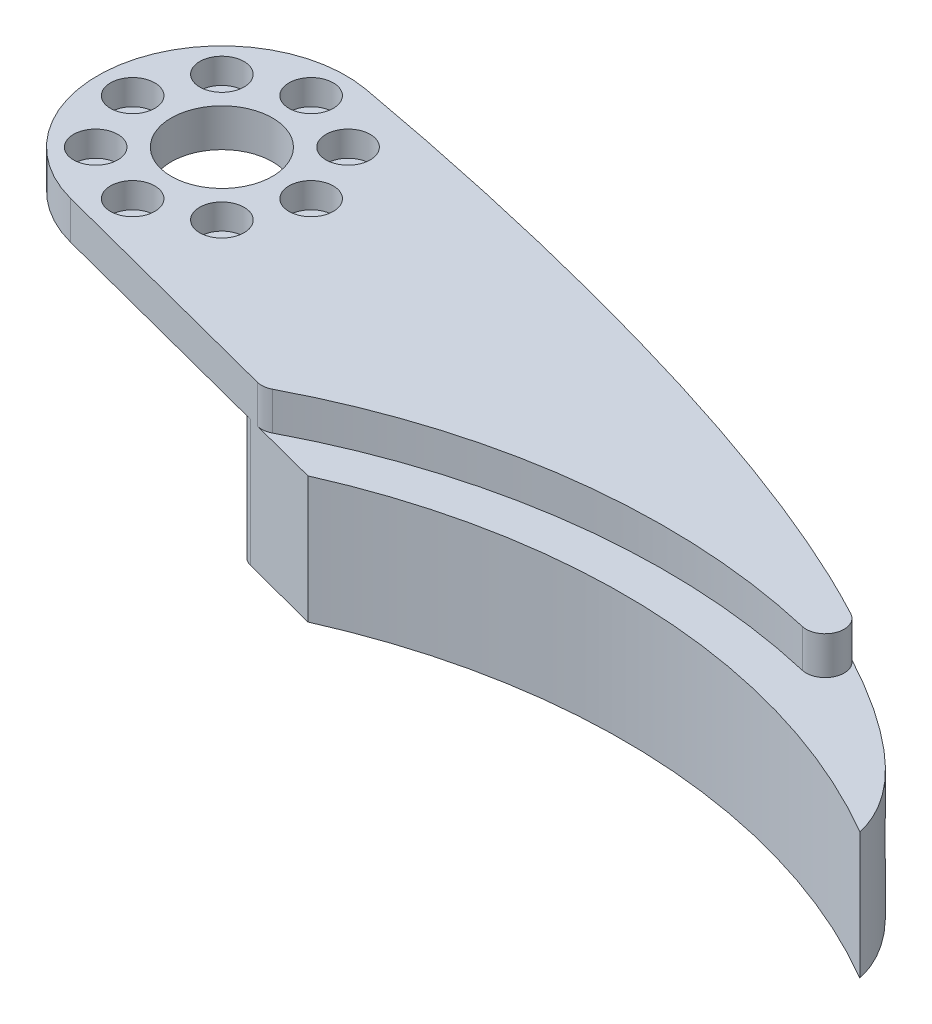
ISO-10303-21;
HEADER;
FILE_DESCRIPTION(('STEP AP214'),'2;1');
FILE_NAME('part.step','',(''),(''),'','','');
FILE_SCHEMA(('AUTOMOTIVE_DESIGN { 1 0 10303 214 1 1 1 1 }'));
ENDSEC;
DATA;
#1=APPLICATION_CONTEXT('core data for automotive mechanical design processes');
#2=APPLICATION_PROTOCOL_DEFINITION('international standard','automotive_design',2000,#1);
#3=PRODUCT_CONTEXT('',#1,'mechanical');
#4=PRODUCT('Part','Part','',(#3));
#5=PRODUCT_RELATED_PRODUCT_CATEGORY('part','',(#4));
#6=PRODUCT_DEFINITION_FORMATION('','',#4);
#7=PRODUCT_DEFINITION_CONTEXT('part definition',#1,'design');
#8=PRODUCT_DEFINITION('design','',#6,#7);
#9=PRODUCT_DEFINITION_SHAPE('','',#8);
#10=(LENGTH_UNIT() NAMED_UNIT(*) SI_UNIT(.MILLI.,.METRE.));
#11=(NAMED_UNIT(*) PLANE_ANGLE_UNIT() SI_UNIT($,.RADIAN.));
#12=(NAMED_UNIT(*) SI_UNIT($,.STERADIAN.) SOLID_ANGLE_UNIT());
#13=UNCERTAINTY_MEASURE_WITH_UNIT(LENGTH_MEASURE(1.E-05),#10,'distance_accuracy_value','');
#14=(GEOMETRIC_REPRESENTATION_CONTEXT(3) GLOBAL_UNCERTAINTY_ASSIGNED_CONTEXT((#13)) GLOBAL_UNIT_ASSIGNED_CONTEXT((#10,
#11,#12)) REPRESENTATION_CONTEXT('',''));
#15=CARTESIAN_POINT('',(0.,0.,0.));
#16=DIRECTION('',(0.,0.,1.));
#17=DIRECTION('',(1.,0.,0.));
#18=AXIS2_PLACEMENT_3D('',#15,#16,#17);
#19=CARTESIAN_POINT('',(4.98510280736516,3.,-4.98510280736516));
#20=DIRECTION('',(0.,-1.,0.));
#21=DIRECTION('',(0.,0.,-1.));
#22=AXIS2_PLACEMENT_3D('',#19,#20,#21);
#23=CYLINDRICAL_SURFACE('',#22,1.);
#24=CARTESIAN_POINT('',(4.98510280736516,0.,-4.98510280736516));
#25=DIRECTION('',(0.,1.,0.));
#26=DIRECTION('',(0.,0.,1.));
#27=AXIS2_PLACEMENT_3D('',#24,#25,#26);
#28=CIRCLE('',#27,1.);
#29=CARTESIAN_POINT('',(4.98510280736516,0.,-3.98510280736516));
#30=VERTEX_POINT('',#29);
#31=EDGE_CURVE('E306',#30,#30,#28,.T.);
#32=ORIENTED_EDGE('',*,*,#31,.F.);
#33=EDGE_LOOP('',(#32));
#34=FACE_BOUND('',#33,.T.);
#35=CARTESIAN_POINT('',(4.98510280736516,1.,-4.98510280736516));
#36=DIRECTION('',(0.,1.,0.));
#37=DIRECTION('',(0.,0.,1.));
#38=AXIS2_PLACEMENT_3D('',#35,#36,#37);
#39=CIRCLE('',#38,1.);
#40=CARTESIAN_POINT('',(4.98510280736516,1.,-3.98510280736516));
#41=VERTEX_POINT('',#40);
#42=EDGE_CURVE('E169',#41,#41,#39,.T.);
#43=ORIENTED_EDGE('',*,*,#42,.T.);
#44=EDGE_LOOP('',(#43));
#45=FACE_BOUND('',#44,.T.);
#46=ADVANCED_FACE('F45',(#34,#45),#23,.F.);
#47=CARTESIAN_POINT('',(7.05,3.,0.));
#48=DIRECTION('',(0.,-1.,0.));
#49=DIRECTION('',(0.,0.,-1.));
#50=AXIS2_PLACEMENT_3D('',#47,#48,#49);
#51=CYLINDRICAL_SURFACE('',#50,1.);
#52=CARTESIAN_POINT('',(7.05,0.,0.));
#53=DIRECTION('',(0.,1.,0.));
#54=DIRECTION('',(0.,0.,1.));
#55=AXIS2_PLACEMENT_3D('',#52,#53,#54);
#56=CIRCLE('',#55,1.);
#57=CARTESIAN_POINT('',(7.05,0.,1.));
#58=VERTEX_POINT('',#57);
#59=EDGE_CURVE('E303',#58,#58,#56,.T.);
#60=ORIENTED_EDGE('',*,*,#59,.F.);
#61=EDGE_LOOP('',(#60));
#62=FACE_BOUND('',#61,.T.);
#63=CARTESIAN_POINT('',(7.05,1.,0.));
#64=DIRECTION('',(0.,1.,0.));
#65=DIRECTION('',(0.,0.,1.));
#66=AXIS2_PLACEMENT_3D('',#63,#64,#65);
#67=CIRCLE('',#66,1.);
#68=CARTESIAN_POINT('',(7.05,1.,1.));
#69=VERTEX_POINT('',#68);
#70=EDGE_CURVE('E334',#69,#69,#67,.T.);
#71=ORIENTED_EDGE('',*,*,#70,.T.);
#72=EDGE_LOOP('',(#71));
#73=FACE_BOUND('',#72,.T.);
#74=ADVANCED_FACE('F217',(#62,#73),#51,.F.);
#75=CARTESIAN_POINT('',(4.98510280736516,3.,4.98510280736516));
#76=DIRECTION('',(0.,-1.,0.));
#77=DIRECTION('',(0.,0.,-1.));
#78=AXIS2_PLACEMENT_3D('',#75,#76,#77);
#79=CYLINDRICAL_SURFACE('',#78,1.);
#80=CARTESIAN_POINT('',(4.98510280736516,0.,4.98510280736516));
#81=DIRECTION('',(0.,1.,0.));
#82=DIRECTION('',(0.,0.,1.));
#83=AXIS2_PLACEMENT_3D('',#80,#81,#82);
#84=CIRCLE('',#83,1.);
#85=CARTESIAN_POINT('',(4.98510280736516,0.,5.98510280736516));
#86=VERTEX_POINT('',#85);
#87=EDGE_CURVE('E300',#86,#86,#84,.T.);
#88=ORIENTED_EDGE('',*,*,#87,.F.);
#89=EDGE_LOOP('',(#88));
#90=FACE_BOUND('',#89,.T.);
#91=CARTESIAN_POINT('',(4.98510280736516,1.,4.98510280736516));
#92=DIRECTION('',(0.,1.,0.));
#93=DIRECTION('',(0.,0.,1.));
#94=AXIS2_PLACEMENT_3D('',#91,#92,#93);
#95=CIRCLE('',#94,1.);
#96=CARTESIAN_POINT('',(4.98510280736516,1.,5.98510280736516));
#97=VERTEX_POINT('',#96);
#98=EDGE_CURVE('E331',#97,#97,#95,.T.);
#99=ORIENTED_EDGE('',*,*,#98,.T.);
#100=EDGE_LOOP('',(#99));
#101=FACE_BOUND('',#100,.T.);
#102=ADVANCED_FACE('F224',(#90,#101),#79,.F.);
#103=CARTESIAN_POINT('',(0.,3.,7.05));
#104=DIRECTION('',(0.,-1.,0.));
#105=DIRECTION('',(0.,0.,-1.));
#106=AXIS2_PLACEMENT_3D('',#103,#104,#105);
#107=CYLINDRICAL_SURFACE('',#106,1.);
#108=CARTESIAN_POINT('',(0.,0.,7.05));
#109=DIRECTION('',(0.,1.,0.));
#110=DIRECTION('',(0.,0.,1.));
#111=AXIS2_PLACEMENT_3D('',#108,#109,#110);
#112=CIRCLE('',#111,1.);
#113=CARTESIAN_POINT('',(0.,0.,8.05));
#114=VERTEX_POINT('',#113);
#115=EDGE_CURVE('E297',#114,#114,#112,.T.);
#116=ORIENTED_EDGE('',*,*,#115,.F.);
#117=EDGE_LOOP('',(#116));
#118=FACE_BOUND('',#117,.T.);
#119=CARTESIAN_POINT('',(0.,1.,7.05));
#120=DIRECTION('',(0.,1.,0.));
#121=DIRECTION('',(0.,0.,1.));
#122=AXIS2_PLACEMENT_3D('',#119,#120,#121);
#123=CIRCLE('',#122,1.);
#124=CARTESIAN_POINT('',(0.,1.,8.05));
#125=VERTEX_POINT('',#124);
#126=EDGE_CURVE('E328',#125,#125,#123,.T.);
#127=ORIENTED_EDGE('',*,*,#126,.T.);
#128=EDGE_LOOP('',(#127));
#129=FACE_BOUND('',#128,.T.);
#130=ADVANCED_FACE('F234',(#118,#129),#107,.F.);
#131=CARTESIAN_POINT('',(-4.98510280736516,3.,4.98510280736516));
#132=DIRECTION('',(0.,-1.,0.));
#133=DIRECTION('',(0.,0.,-1.));
#134=AXIS2_PLACEMENT_3D('',#131,#132,#133);
#135=CYLINDRICAL_SURFACE('',#134,1.);
#136=CARTESIAN_POINT('',(-4.98510280736516,0.,4.98510280736516));
#137=DIRECTION('',(0.,1.,0.));
#138=DIRECTION('',(0.,0.,1.));
#139=AXIS2_PLACEMENT_3D('',#136,#137,#138);
#140=CIRCLE('',#139,1.);
#141=CARTESIAN_POINT('',(-4.98510280736516,0.,5.98510280736516));
#142=VERTEX_POINT('',#141);
#143=EDGE_CURVE('E294',#142,#142,#140,.T.);
#144=ORIENTED_EDGE('',*,*,#143,.F.);
#145=EDGE_LOOP('',(#144));
#146=FACE_BOUND('',#145,.T.);
#147=CARTESIAN_POINT('',(-4.98510280736516,1.,4.98510280736516));
#148=DIRECTION('',(0.,1.,0.));
#149=DIRECTION('',(0.,0.,1.));
#150=AXIS2_PLACEMENT_3D('',#147,#148,#149);
#151=CIRCLE('',#150,1.);
#152=CARTESIAN_POINT('',(-4.98510280736516,1.,5.98510280736516));
#153=VERTEX_POINT('',#152);
#154=EDGE_CURVE('E325',#153,#153,#151,.T.);
#155=ORIENTED_EDGE('',*,*,#154,.T.);
#156=EDGE_LOOP('',(#155));
#157=FACE_BOUND('',#156,.T.);
#158=ADVANCED_FACE('F238',(#146,#157),#135,.F.);
#159=CARTESIAN_POINT('',(-7.05,3.,0.));
#160=DIRECTION('',(0.,-1.,0.));
#161=DIRECTION('',(0.,0.,-1.));
#162=AXIS2_PLACEMENT_3D('',#159,#160,#161);
#163=CYLINDRICAL_SURFACE('',#162,1.);
#164=CARTESIAN_POINT('',(-7.05,0.,0.));
#165=DIRECTION('',(0.,1.,0.));
#166=DIRECTION('',(0.,0.,1.));
#167=AXIS2_PLACEMENT_3D('',#164,#165,#166);
#168=CIRCLE('',#167,1.);
#169=CARTESIAN_POINT('',(-7.05,0.,1.));
#170=VERTEX_POINT('',#169);
#171=EDGE_CURVE('E291',#170,#170,#168,.T.);
#172=ORIENTED_EDGE('',*,*,#171,.F.);
#173=EDGE_LOOP('',(#172));
#174=FACE_BOUND('',#173,.T.);
#175=CARTESIAN_POINT('',(-7.05,1.,0.));
#176=DIRECTION('',(0.,1.,0.));
#177=DIRECTION('',(0.,0.,1.));
#178=AXIS2_PLACEMENT_3D('',#175,#176,#177);
#179=CIRCLE('',#178,1.);
#180=CARTESIAN_POINT('',(-7.05,1.,1.));
#181=VERTEX_POINT('',#180);
#182=EDGE_CURVE('E322',#181,#181,#179,.T.);
#183=ORIENTED_EDGE('',*,*,#182,.T.);
#184=EDGE_LOOP('',(#183));
#185=FACE_BOUND('',#184,.T.);
#186=ADVANCED_FACE('F242',(#174,#185),#163,.F.);
#187=CARTESIAN_POINT('',(-4.98510280736516,3.,-4.98510280736516));
#188=DIRECTION('',(0.,-1.,0.));
#189=DIRECTION('',(0.,0.,-1.));
#190=AXIS2_PLACEMENT_3D('',#187,#188,#189);
#191=CYLINDRICAL_SURFACE('',#190,1.);
#192=CARTESIAN_POINT('',(-4.98510280736516,0.,-4.98510280736516));
#193=DIRECTION('',(0.,1.,0.));
#194=DIRECTION('',(0.,0.,1.));
#195=AXIS2_PLACEMENT_3D('',#192,#193,#194);
#196=CIRCLE('',#195,1.);
#197=CARTESIAN_POINT('',(-4.98510280736516,0.,-3.98510280736516));
#198=VERTEX_POINT('',#197);
#199=EDGE_CURVE('E288',#198,#198,#196,.T.);
#200=ORIENTED_EDGE('',*,*,#199,.F.);
#201=EDGE_LOOP('',(#200));
#202=FACE_BOUND('',#201,.T.);
#203=CARTESIAN_POINT('',(-4.98510280736516,1.,-4.98510280736516));
#204=DIRECTION('',(0.,1.,0.));
#205=DIRECTION('',(0.,0.,1.));
#206=AXIS2_PLACEMENT_3D('',#203,#204,#205);
#207=CIRCLE('',#206,1.);
#208=CARTESIAN_POINT('',(-4.98510280736516,1.,-3.98510280736516));
#209=VERTEX_POINT('',#208);
#210=EDGE_CURVE('E318',#209,#209,#207,.T.);
#211=ORIENTED_EDGE('',*,*,#210,.T.);
#212=EDGE_LOOP('',(#211));
#213=FACE_BOUND('',#212,.T.);
#214=ADVANCED_FACE('F246',(#202,#213),#191,.F.);
#215=CARTESIAN_POINT('',(0.,3.,-7.05));
#216=DIRECTION('',(0.,-1.,0.));
#217=DIRECTION('',(0.,0.,-1.));
#218=AXIS2_PLACEMENT_3D('',#215,#216,#217);
#219=CYLINDRICAL_SURFACE('',#218,1.);
#220=CARTESIAN_POINT('',(0.,0.,-7.05));
#221=DIRECTION('',(0.,1.,0.));
#222=DIRECTION('',(0.,0.,1.));
#223=AXIS2_PLACEMENT_3D('',#220,#221,#222);
#224=CIRCLE('',#223,1.);
#225=CARTESIAN_POINT('',(0.,0.,-6.05));
#226=VERTEX_POINT('',#225);
#227=EDGE_CURVE('E187',#226,#226,#224,.T.);
#228=ORIENTED_EDGE('',*,*,#227,.F.);
#229=EDGE_LOOP('',(#228));
#230=FACE_BOUND('',#229,.T.);
#231=CARTESIAN_POINT('',(0.,1.,-7.05));
#232=DIRECTION('',(0.,1.,0.));
#233=DIRECTION('',(0.,0.,1.));
#234=AXIS2_PLACEMENT_3D('',#231,#232,#233);
#235=CIRCLE('',#234,1.);
#236=CARTESIAN_POINT('',(0.,1.,-6.05));
#237=VERTEX_POINT('',#236);
#238=EDGE_CURVE('E315',#237,#237,#235,.T.);
#239=ORIENTED_EDGE('',*,*,#238,.T.);
#240=EDGE_LOOP('',(#239));
#241=FACE_BOUND('',#240,.T.);
#242=ADVANCED_FACE('F198',(#230,#241),#219,.F.);
#243=CARTESIAN_POINT('',(1.75302173497441,3.,-9.64193522052017));
#244=CARTESIAN_POINT('',(36.7830483573597,3.,-3.27304799598428));
#245=CARTESIAN_POINT('',(66.7324408129762,3.,7.92121814505391));
#246=CARTESIAN_POINT('',(69.0419589287704,3.,18.6455545202918));
#247=B_SPLINE_CURVE_WITH_KNOTS('',3,(#243,#244,#245,#246),.UNSPECIFIED.,.F.,.F.,(4,4),(0.,1.),.UNSPECIFIED.);
#248=DIRECTION('',(0.,-1.,0.));
#249=VECTOR('',#248,1.);
#250=SURFACE_OF_LINEAR_EXTRUSION('',#247,#249);
#251=CARTESIAN_POINT('',(1.75302173497441,-10.,-9.64193522052017));
#252=CARTESIAN_POINT('',(36.7830483573597,-10.,-3.27304799598428));
#253=CARTESIAN_POINT('',(66.7324408129762,-10.,7.92121814505391));
#254=CARTESIAN_POINT('',(69.0419589287704,-10.,18.6455545202918));
#255=B_SPLINE_CURVE_WITH_KNOTS('',3,(#251,#252,#253,#254),.UNSPECIFIED.,.F.,.F.,(4,4),(0.,1.),.UNSPECIFIED.);
#256=CARTESIAN_POINT('',(55.0089054922224,-10.,6.16908967782891));
#257=VERTEX_POINT('',#256);
#258=CARTESIAN_POINT('',(69.0419589287705,-10.,18.6455545202918));
#259=VERTEX_POINT('',#258);
#260=EDGE_CURVE('E159',#257,#259,#255,.T.);
#261=ORIENTED_EDGE('',*,*,#260,.F.);
#262=DIRECTION('',(0.,-1.,0.));
#263=VECTOR('',#262,1.);
#264=CARTESIAN_POINT('',(55.0089054922224,-10.,6.16908967782892));
#265=LINE('',#264,#263);
#266=CARTESIAN_POINT('',(55.0089054922136,0.,6.1690896778245));
#267=VERTEX_POINT('',#266);
#268=EDGE_CURVE('E341',#257,#267,#265,.F.);
#269=ORIENTED_EDGE('',*,*,#268,.T.);
#270=CARTESIAN_POINT('',(1.75302173497441,0.,-9.64193522052017));
#271=CARTESIAN_POINT('',(36.7830483573597,0.,-3.27304799598428));
#272=CARTESIAN_POINT('',(66.7324408129762,0.,7.92121814505391));
#273=CARTESIAN_POINT('',(69.0419589287704,0.,18.6455545202918));
#274=B_SPLINE_CURVE_WITH_KNOTS('',3,(#270,#271,#272,#273),.UNSPECIFIED.,.F.,.F.,(4,4),(0.,1.),.UNSPECIFIED.);
#275=CARTESIAN_POINT('',(1.75302173497441,0.,-9.64193522052017));
#276=VERTEX_POINT('',#275);
#277=EDGE_CURVE('E178',#276,#267,#274,.T.);
#278=ORIENTED_EDGE('',*,*,#277,.F.);
#279=DIRECTION('',(0.,-1.,0.));
#280=VECTOR('',#279,1.);
#281=CARTESIAN_POINT('',(1.75302173497441,3.,-9.64193522052017));
#282=LINE('',#281,#280);
#283=CARTESIAN_POINT('',(1.75302173497441,3.,-9.64193522052017));
#284=VERTEX_POINT('',#283);
#285=EDGE_CURVE('E272',#284,#276,#282,.T.);
#286=ORIENTED_EDGE('',*,*,#285,.F.);
#287=CARTESIAN_POINT('',(56.770531976888,3.,7.08288433158837));
#288=VERTEX_POINT('',#287);
#289=EDGE_CURVE('E180',#284,#288,#247,.T.);
#290=ORIENTED_EDGE('',*,*,#289,.T.);
#291=DIRECTION('',(0.,-1.,0.));
#292=VECTOR('',#291,1.);
#293=CARTESIAN_POINT('',(56.770531976888,3.,7.0828843315884));
#294=LINE('',#293,#292);
#295=CARTESIAN_POINT('',(56.770531976888,0.,7.08288433158839));
#296=VERTEX_POINT('',#295);
#297=EDGE_CURVE('E314',#288,#296,#294,.T.);
#298=ORIENTED_EDGE('',*,*,#297,.T.);
#299=CARTESIAN_POINT('',(1.75302173497441,0.,-9.64193522052017));
#300=CARTESIAN_POINT('',(36.7830483573597,0.,-3.27304799598428));
#301=CARTESIAN_POINT('',(66.7324408129762,0.,7.92121814505391));
#302=CARTESIAN_POINT('',(69.0419589287704,0.,18.6455545202918));
#303=B_SPLINE_CURVE_WITH_KNOTS('',3,(#299,#300,#301,#302),.UNSPECIFIED.,.F.,.F.,(4,4),(0.,1.),.UNSPECIFIED.);
#304=CARTESIAN_POINT('',(69.0419589287705,0.,18.6455545202918));
#305=VERTEX_POINT('',#304);
#306=EDGE_CURVE('E164',#296,#305,#303,.T.);
#307=ORIENTED_EDGE('',*,*,#306,.T.);
#308=DIRECTION('',(0.,1.,0.));
#309=VECTOR('',#308,1.);
#310=CARTESIAN_POINT('',(69.0419589287705,-10.,18.6455545202918));
#311=LINE('',#310,#309);
#312=EDGE_CURVE('E145',#259,#305,#311,.T.);
#313=ORIENTED_EDGE('',*,*,#312,.F.);
#314=EDGE_LOOP('',(#261,#269,#278,#286,#290,#298,#307,#313));
#315=FACE_BOUND('',#314,.T.);
#316=ADVANCED_FACE('F193',(#315),#250,.T.);
#317=CARTESIAN_POINT('',(0.,3.,0.));
#318=DIRECTION('',(0.,-1.,0.));
#319=DIRECTION('',(0.,0.,-1.));
#320=AXIS2_PLACEMENT_3D('',#317,#318,#319);
#321=CYLINDRICAL_SURFACE('',#320,9.8);
#322=CARTESIAN_POINT('',(0.,0.,0.));
#323=DIRECTION('',(0.,1.,0.));
#324=DIRECTION('',(0.,0.,1.));
#325=AXIS2_PLACEMENT_3D('',#322,#323,#324);
#326=CIRCLE('',#325,9.8);
#327=CARTESIAN_POINT('',(-2.47048704337769,0.,9.4834958622073));
#328=VERTEX_POINT('',#327);
#329=EDGE_CURVE('E268',#276,#328,#326,.T.);
#330=ORIENTED_EDGE('',*,*,#329,.T.);
#331=DIRECTION('',(0.,-1.,0.));
#332=VECTOR('',#331,1.);
#333=CARTESIAN_POINT('',(-2.47048704337769,3.,9.4834958622073));
#334=LINE('',#333,#332);
#335=CARTESIAN_POINT('',(-2.47048704337769,3.,9.4834958622073));
#336=VERTEX_POINT('',#335);
#337=EDGE_CURVE('E271',#336,#328,#334,.T.);
#338=ORIENTED_EDGE('',*,*,#337,.F.);
#339=CARTESIAN_POINT('',(0.,3.,0.));
#340=DIRECTION('',(0.,1.,0.));
#341=DIRECTION('',(0.,0.,1.));
#342=AXIS2_PLACEMENT_3D('',#339,#340,#341);
#343=CIRCLE('',#342,9.8);
#344=EDGE_CURVE('E186',#284,#336,#343,.T.);
#345=ORIENTED_EDGE('',*,*,#344,.F.);
#346=ORIENTED_EDGE('',*,*,#285,.T.);
#347=EDGE_LOOP('',(#330,#338,#345,#346));
#348=FACE_BOUND('',#347,.T.);
#349=ADVANCED_FACE('F197',(#348),#321,.T.);
#350=CARTESIAN_POINT('',(-2.47048704337769,3.,9.4834958622073));
#351=DIRECTION('',(-0.252090514630377,0.,0.967703659408908));
#352=DIRECTION('',(0.967703659408908,0.,0.252090514630377));
#353=AXIS2_PLACEMENT_3D('',#350,#351,#352);
#354=PLANE('',#353);
#355=DIRECTION('',(-0.967703659408908,0.,-0.252090514630377));
#356=VECTOR('',#355,1.);
#357=CARTESIAN_POINT('',(-2.47048704337769,0.,9.4834958622073));
#358=LINE('',#357,#356);
#359=CARTESIAN_POINT('',(16.7542198939808,0.,14.4916057503286));
#360=VERTEX_POINT('',#359);
#361=EDGE_CURVE('E275',#360,#328,#358,.T.);
#362=ORIENTED_EDGE('',*,*,#361,.F.);
#363=DIRECTION('',(0.,-1.,0.));
#364=VECTOR('',#363,1.);
#365=CARTESIAN_POINT('',(16.7542198939808,-10.,14.4916057503286));
#366=LINE('',#365,#364);
#367=CARTESIAN_POINT('',(16.7542198939808,-10.,14.4916057503286));
#368=VERTEX_POINT('',#367);
#369=EDGE_CURVE('E151',#360,#368,#366,.T.);
#370=ORIENTED_EDGE('',*,*,#369,.T.);
#371=DIRECTION('',(-0.967703659408908,0.,-0.252090514630377));
#372=VECTOR('',#371,1.);
#373=CARTESIAN_POINT('',(-2.47048704337769,-10.,9.4834958622073));
#374=LINE('',#373,#372);
#375=CARTESIAN_POINT('',(22.89,-10.,16.09));
#376=VERTEX_POINT('',#375);
#377=EDGE_CURVE('E148',#376,#368,#374,.T.);
#378=ORIENTED_EDGE('',*,*,#377,.F.);
#379=DIRECTION('',(0.,1.,0.));
#380=VECTOR('',#379,1.);
#381=CARTESIAN_POINT('',(22.89,-10.,16.09));
#382=LINE('',#381,#380);
#383=CARTESIAN_POINT('',(22.89,0.,16.09));
#384=VERTEX_POINT('',#383);
#385=EDGE_CURVE('E135',#376,#384,#382,.T.);
#386=ORIENTED_EDGE('',*,*,#385,.T.);
#387=DIRECTION('',(-0.967703659408908,0.,-0.252090514630377));
#388=VECTOR('',#387,1.);
#389=CARTESIAN_POINT('',(-2.47048704337769,0.,9.4834958622073));
#390=LINE('',#389,#388);
#391=CARTESIAN_POINT('',(17.4878592241282,0.,14.6827216094986));
#392=VERTEX_POINT('',#391);
#393=EDGE_CURVE('E175',#384,#392,#390,.T.);
#394=ORIENTED_EDGE('',*,*,#393,.T.);
#395=DIRECTION('',(0.,1.,0.));
#396=VECTOR('',#395,1.);
#397=CARTESIAN_POINT('',(17.4878592241282,3.,14.6827216094986));
#398=LINE('',#397,#396);
#399=CARTESIAN_POINT('',(17.4878592241282,3.,14.6827216094986));
#400=VERTEX_POINT('',#399);
#401=EDGE_CURVE('E353',#392,#400,#398,.T.);
#402=ORIENTED_EDGE('',*,*,#401,.T.);
#403=DIRECTION('',(-0.967703659408908,0.,-0.252090514630377));
#404=VECTOR('',#403,1.);
#405=CARTESIAN_POINT('',(-2.47048704337769,3.,9.4834958622073));
#406=LINE('',#405,#404);
#407=EDGE_CURVE('E373',#400,#336,#406,.T.);
#408=ORIENTED_EDGE('',*,*,#407,.T.);
#409=ORIENTED_EDGE('',*,*,#337,.T.);
#410=EDGE_LOOP('',(#362,#370,#378,#386,#394,#402,#408,#409));
#411=FACE_BOUND('',#410,.T.);
#412=ADVANCED_FACE('F149',(#411),#354,.T.);
#413=CARTESIAN_POINT('',(0.,3.,0.));
#414=DIRECTION('',(0.,-1.,0.));
#415=DIRECTION('',(0.,0.,-1.));
#416=AXIS2_PLACEMENT_3D('',#413,#414,#415);
#417=CYLINDRICAL_SURFACE('',#416,4.);
#418=CARTESIAN_POINT('',(0.,3.,0.));
#419=DIRECTION('',(0.,1.,0.));
#420=DIRECTION('',(0.,0.,1.));
#421=AXIS2_PLACEMENT_3D('',#418,#419,#420);
#422=CIRCLE('',#421,4.);
#423=CARTESIAN_POINT('',(0.,3.,4.));
#424=VERTEX_POINT('',#423);
#425=EDGE_CURVE('E312',#424,#424,#422,.T.);
#426=ORIENTED_EDGE('',*,*,#425,.T.);
#427=EDGE_LOOP('',(#426));
#428=FACE_BOUND('',#427,.T.);
#429=CARTESIAN_POINT('',(0.,0.,0.));
#430=DIRECTION('',(0.,1.,0.));
#431=DIRECTION('',(0.,0.,1.));
#432=AXIS2_PLACEMENT_3D('',#429,#430,#431);
#433=CIRCLE('',#432,4.);
#434=CARTESIAN_POINT('',(0.,0.,4.));
#435=VERTEX_POINT('',#434);
#436=EDGE_CURVE('E285',#435,#435,#433,.T.);
#437=ORIENTED_EDGE('',*,*,#436,.F.);
#438=EDGE_LOOP('',(#437));
#439=FACE_BOUND('',#438,.T.);
#440=ADVANCED_FACE('F251',(#428,#439),#417,.F.);
#441=CARTESIAN_POINT('',(43.4752402140338,3.,62.3492067979381));
#442=DIRECTION('',(0.,-1.,0.));
#443=DIRECTION('',(0.,0.,-1.));
#444=AXIS2_PLACEMENT_3D('',#441,#442,#443);
#445=CYLINDRICAL_SURFACE('',#444,53.8932790204312);
#446=CARTESIAN_POINT('',(43.4752402140338,3.,62.3492067979381));
#447=DIRECTION('',(0.,1.,0.));
#448=DIRECTION('',(0.,0.,1.));
#449=AXIS2_PLACEMENT_3D('',#446,#447,#448);
#450=CIRCLE('',#449,53.8932790204312);
#451=CARTESIAN_POINT('',(18.5594702426424,3.,14.5612383298523));
#452=VERTEX_POINT('',#451);
#453=CARTESIAN_POINT('',(55.7208315840572,3.,9.86558063155685));
#454=VERTEX_POINT('',#453);
#455=EDGE_CURVE('E377',#452,#454,#450,.F.);
#456=ORIENTED_EDGE('',*,*,#455,.F.);
#457=DIRECTION('',(0.,-1.,0.));
#458=VECTOR('',#457,1.);
#459=CARTESIAN_POINT('',(18.5594702426424,3.,14.5612383298523));
#460=LINE('',#459,#458);
#461=CARTESIAN_POINT('',(18.5594702426424,0.,14.5612383298523));
#462=VERTEX_POINT('',#461);
#463=EDGE_CURVE('E357',#452,#462,#460,.T.);
#464=ORIENTED_EDGE('',*,*,#463,.T.);
#465=CARTESIAN_POINT('',(43.4752402140338,0.,62.3492067979381));
#466=DIRECTION('',(0.,1.,0.));
#467=DIRECTION('',(0.,0.,1.));
#468=AXIS2_PLACEMENT_3D('',#465,#466,#467);
#469=CIRCLE('',#468,53.8932790204312);
#470=CARTESIAN_POINT('',(55.7208315840572,0.,9.86558063155685));
#471=VERTEX_POINT('',#470);
#472=EDGE_CURVE('E277',#462,#471,#469,.F.);
#473=ORIENTED_EDGE('',*,*,#472,.T.);
#474=DIRECTION('',(0.,-1.,0.));
#475=VECTOR('',#474,1.);
#476=CARTESIAN_POINT('',(55.7208315840572,3.,9.86558063155685));
#477=LINE('',#476,#475);
#478=EDGE_CURVE('E60',#471,#454,#477,.F.);
#479=ORIENTED_EDGE('',*,*,#478,.T.);
#480=EDGE_LOOP('',(#456,#464,#473,#479));
#481=FACE_BOUND('',#480,.T.);
#482=ADVANCED_FACE('F254',(#481),#445,.F.);
#483=CARTESIAN_POINT('',(0.,3.,0.));
#484=DIRECTION('',(0.,1.,0.));
#485=DIRECTION('',(0.,0.,1.));
#486=AXIS2_PLACEMENT_3D('',#483,#484,#485);
#487=PLANE('',#486);
#488=CARTESIAN_POINT('',(-4.98510280736516,3.,-4.98510280736516));
#489=DIRECTION('',(0.,1.,0.));
#490=DIRECTION('',(0.,0.,1.));
#491=AXIS2_PLACEMENT_3D('',#488,#489,#490);
#492=CIRCLE('',#491,1.75);
#493=CARTESIAN_POINT('',(-4.98510280736516,3.,-3.23510280736516));
#494=VERTEX_POINT('',#493);
#495=EDGE_CURVE('E507',#494,#494,#492,.T.);
#496=ORIENTED_EDGE('',*,*,#495,.F.);
#497=EDGE_LOOP('',(#496));
#498=FACE_BOUND('',#497,.T.);
#499=CARTESIAN_POINT('',(-7.05,3.,0.));
#500=DIRECTION('',(0.,1.,0.));
#501=DIRECTION('',(0.,0.,1.));
#502=AXIS2_PLACEMENT_3D('',#499,#500,#501);
#503=CIRCLE('',#502,1.75);
#504=CARTESIAN_POINT('',(-7.05,3.,1.75));
#505=VERTEX_POINT('',#504);
#506=EDGE_CURVE('E501',#505,#505,#503,.T.);
#507=ORIENTED_EDGE('',*,*,#506,.F.);
#508=EDGE_LOOP('',(#507));
#509=FACE_BOUND('',#508,.T.);
#510=CARTESIAN_POINT('',(-4.98510280736516,3.,4.98510280736516));
#511=DIRECTION('',(0.,1.,0.));
#512=DIRECTION('',(0.,0.,1.));
#513=AXIS2_PLACEMENT_3D('',#510,#511,#512);
#514=CIRCLE('',#513,1.75);
#515=CARTESIAN_POINT('',(-4.98510280736516,3.,6.73510280736516));
#516=VERTEX_POINT('',#515);
#517=EDGE_CURVE('E495',#516,#516,#514,.T.);
#518=ORIENTED_EDGE('',*,*,#517,.F.);
#519=EDGE_LOOP('',(#518));
#520=FACE_BOUND('',#519,.T.);
#521=CARTESIAN_POINT('',(0.,3.,7.05));
#522=DIRECTION('',(0.,1.,0.));
#523=DIRECTION('',(0.,0.,1.));
#524=AXIS2_PLACEMENT_3D('',#521,#522,#523);
#525=CIRCLE('',#524,1.75);
#526=CARTESIAN_POINT('',(0.,3.,8.8));
#527=VERTEX_POINT('',#526);
#528=EDGE_CURVE('E489',#527,#527,#525,.T.);
#529=ORIENTED_EDGE('',*,*,#528,.F.);
#530=EDGE_LOOP('',(#529));
#531=FACE_BOUND('',#530,.T.);
#532=CARTESIAN_POINT('',(4.98510280736516,3.,4.98510280736516));
#533=DIRECTION('',(0.,1.,0.));
#534=DIRECTION('',(0.,0.,1.));
#535=AXIS2_PLACEMENT_3D('',#532,#533,#534);
#536=CIRCLE('',#535,1.75);
#537=CARTESIAN_POINT('',(4.98510280736516,3.,6.73510280736516));
#538=VERTEX_POINT('',#537);
#539=EDGE_CURVE('E483',#538,#538,#536,.T.);
#540=ORIENTED_EDGE('',*,*,#539,.F.);
#541=EDGE_LOOP('',(#540));
#542=FACE_BOUND('',#541,.T.);
#543=CARTESIAN_POINT('',(7.05,3.,0.));
#544=DIRECTION('',(0.,1.,0.));
#545=DIRECTION('',(0.,0.,1.));
#546=AXIS2_PLACEMENT_3D('',#543,#544,#545);
#547=CIRCLE('',#546,1.75);
#548=CARTESIAN_POINT('',(7.05,3.,1.75));
#549=VERTEX_POINT('',#548);
#550=EDGE_CURVE('E477',#549,#549,#547,.T.);
#551=ORIENTED_EDGE('',*,*,#550,.F.);
#552=EDGE_LOOP('',(#551));
#553=FACE_BOUND('',#552,.T.);
#554=CARTESIAN_POINT('',(4.98510280736516,3.,-4.98510280736516));
#555=DIRECTION('',(0.,1.,0.));
#556=DIRECTION('',(0.,0.,1.));
#557=AXIS2_PLACEMENT_3D('',#554,#555,#556);
#558=CIRCLE('',#557,1.75);
#559=CARTESIAN_POINT('',(4.98510280736516,3.,-3.23510280736516));
#560=VERTEX_POINT('',#559);
#561=EDGE_CURVE('E471',#560,#560,#558,.T.);
#562=ORIENTED_EDGE('',*,*,#561,.F.);
#563=EDGE_LOOP('',(#562));
#564=FACE_BOUND('',#563,.T.);
#565=CARTESIAN_POINT('',(0.,3.,-7.05));
#566=DIRECTION('',(0.,1.,0.));
#567=DIRECTION('',(0.,0.,1.));
#568=AXIS2_PLACEMENT_3D('',#565,#566,#567);
#569=CIRCLE('',#568,1.75);
#570=CARTESIAN_POINT('',(0.,3.,-5.3));
#571=VERTEX_POINT('',#570);
#572=EDGE_CURVE('E473',#571,#571,#569,.T.);
#573=ORIENTED_EDGE('',*,*,#572,.F.);
#574=EDGE_LOOP('',(#573));
#575=FACE_BOUND('',#574,.T.);
#576=ORIENTED_EDGE('',*,*,#407,.F.);
#577=CARTESIAN_POINT('',(17.8659949960738,3.,13.2311661203853));
#578=DIRECTION('',(0.,1.,0.));
#579=DIRECTION('',(0.,0.,1.));
#580=AXIS2_PLACEMENT_3D('',#577,#578,#579);
#581=CIRCLE('',#580,1.5);
#582=EDGE_CURVE('E67',#400,#452,#581,.T.);
#583=ORIENTED_EDGE('',*,*,#582,.T.);
#584=ORIENTED_EDGE('',*,*,#455,.T.);
#585=CARTESIAN_POINT('',(56.0616604849685,3.,8.40481519511483));
#586=DIRECTION('',(0.,1.,0.));
#587=DIRECTION('',(0.,0.,1.));
#588=AXIS2_PLACEMENT_3D('',#585,#586,#587);
#589=CIRCLE('',#588,1.5);
#590=EDGE_CURVE('E360',#454,#288,#589,.T.);
#591=ORIENTED_EDGE('',*,*,#590,.T.);
#592=ORIENTED_EDGE('',*,*,#289,.F.);
#593=ORIENTED_EDGE('',*,*,#344,.T.);
#594=EDGE_LOOP('',(#576,#583,#584,#591,#592,#593));
#595=FACE_BOUND('',#594,.T.);
#596=ORIENTED_EDGE('',*,*,#425,.F.);
#597=EDGE_LOOP('',(#596));
#598=FACE_BOUND('',#597,.T.);
#599=ADVANCED_FACE('F257',(#498,#509,#520,#531,#542,#553,#564,#575,#595,#598),#487,.T.);
#600=CARTESIAN_POINT('',(0.,0.,0.));
#601=DIRECTION('',(0.,1.,0.));
#602=DIRECTION('',(0.,0.,1.));
#603=AXIS2_PLACEMENT_3D('',#600,#601,#602);
#604=PLANE('',#603);
#605=CARTESIAN_POINT('',(43.4752402140338,0.,62.3492067979381));
#606=DIRECTION('',(0.,1.,0.));
#607=DIRECTION('',(0.,0.,1.));
#608=AXIS2_PLACEMENT_3D('',#605,#606,#607);
#609=CIRCLE('',#608,57.4047447420875);
#610=CARTESIAN_POINT('',(16.4255404035644,0.,11.7170188236099));
#611=VERTEX_POINT('',#610);
#612=CARTESIAN_POINT('',(54.6270601010562,0.,6.03809215693995));
#613=VERTEX_POINT('',#612);
#614=EDGE_CURVE('E168',#611,#613,#609,.F.);
#615=ORIENTED_EDGE('',*,*,#614,.F.);
#616=CARTESIAN_POINT('',(17.1323556659264,0.,13.0400502612152));
#617=DIRECTION('',(0.,1.,0.));
#618=DIRECTION('',(0.,0.,1.));
#619=AXIS2_PLACEMENT_3D('',#616,#617,#618);
#620=CIRCLE('',#619,1.5);
#621=EDGE_CURVE('E365',#611,#360,#620,.T.);
#622=ORIENTED_EDGE('',*,*,#621,.T.);
#623=ORIENTED_EDGE('',*,*,#361,.T.);
#624=ORIENTED_EDGE('',*,*,#329,.F.);
#625=ORIENTED_EDGE('',*,*,#277,.T.);
#626=CARTESIAN_POINT('',(54.3356603238132,0.,7.50951533530257));
#627=DIRECTION('',(0.,1.,0.));
#628=DIRECTION('',(0.,0.,1.));
#629=AXIS2_PLACEMENT_3D('',#626,#627,#628);
#630=CIRCLE('',#629,1.5);
#631=EDGE_CURVE('E363',#267,#613,#630,.T.);
#632=ORIENTED_EDGE('',*,*,#631,.T.);
#633=EDGE_LOOP('',(#615,#622,#623,#624,#625,#632));
#634=FACE_BOUND('',#633,.T.);
#635=ORIENTED_EDGE('',*,*,#436,.T.);
#636=EDGE_LOOP('',(#635));
#637=FACE_BOUND('',#636,.T.);
#638=ORIENTED_EDGE('',*,*,#199,.T.);
#639=EDGE_LOOP('',(#638));
#640=FACE_BOUND('',#639,.T.);
#641=ORIENTED_EDGE('',*,*,#171,.T.);
#642=EDGE_LOOP('',(#641));
#643=FACE_BOUND('',#642,.T.);
#644=ORIENTED_EDGE('',*,*,#143,.T.);
#645=EDGE_LOOP('',(#644));
#646=FACE_BOUND('',#645,.T.);
#647=ORIENTED_EDGE('',*,*,#115,.T.);
#648=EDGE_LOOP('',(#647));
#649=FACE_BOUND('',#648,.T.);
#650=ORIENTED_EDGE('',*,*,#87,.T.);
#651=EDGE_LOOP('',(#650));
#652=FACE_BOUND('',#651,.T.);
#653=ORIENTED_EDGE('',*,*,#59,.T.);
#654=EDGE_LOOP('',(#653));
#655=FACE_BOUND('',#654,.T.);
#656=ORIENTED_EDGE('',*,*,#31,.T.);
#657=EDGE_LOOP('',(#656));
#658=FACE_BOUND('',#657,.T.);
#659=ORIENTED_EDGE('',*,*,#227,.T.);
#660=EDGE_LOOP('',(#659));
#661=FACE_BOUND('',#660,.T.);
#662=ADVANCED_FACE('F383',(#634,#637,#640,#643,#646,#649,#652,#655,#658,#661),#604,.F.);
#663=CARTESIAN_POINT('',(0.,0.,0.));
#664=DIRECTION('',(0.,1.,0.));
#665=DIRECTION('',(0.,0.,1.));
#666=AXIS2_PLACEMENT_3D('',#663,#664,#665);
#667=PLANE('',#666);
#668=ORIENTED_EDGE('',*,*,#472,.F.);
#669=CARTESIAN_POINT('',(17.8659949960738,0.,13.2311661203853));
#670=DIRECTION('',(0.,1.,0.));
#671=DIRECTION('',(0.,0.,1.));
#672=AXIS2_PLACEMENT_3D('',#669,#670,#671);
#673=CIRCLE('',#672,1.5);
#674=EDGE_CURVE('E53',#462,#392,#673,.F.);
#675=ORIENTED_EDGE('',*,*,#674,.T.);
#676=ORIENTED_EDGE('',*,*,#393,.F.);
#677=CARTESIAN_POINT('',(43.4752402140338,0.,62.3492067979381));
#678=DIRECTION('',(0.,1.,0.));
#679=DIRECTION('',(0.,0.,1.));
#680=AXIS2_PLACEMENT_3D('',#677,#678,#679);
#681=CIRCLE('',#680,50.6326606869902);
#682=EDGE_CURVE('E142',#384,#305,#681,.F.);
#683=ORIENTED_EDGE('',*,*,#682,.T.);
#684=ORIENTED_EDGE('',*,*,#306,.F.);
#685=CARTESIAN_POINT('',(56.0616604849685,0.,8.40481519511483));
#686=DIRECTION('',(0.,1.,0.));
#687=DIRECTION('',(0.,0.,1.));
#688=AXIS2_PLACEMENT_3D('',#685,#686,#687);
#689=CIRCLE('',#688,1.5);
#690=EDGE_CURVE('E12',#296,#471,#689,.F.);
#691=ORIENTED_EDGE('',*,*,#690,.T.);
#692=EDGE_LOOP('',(#668,#675,#676,#683,#684,#691));
#693=FACE_BOUND('',#692,.T.);
#694=ADVANCED_FACE('F371',(#693),#667,.T.);
#695=CARTESIAN_POINT('',(43.4752402140338,-10.,62.3492067979381));
#696=DIRECTION('',(0.,1.,0.));
#697=DIRECTION('',(0.,0.,1.));
#698=AXIS2_PLACEMENT_3D('',#695,#696,#697);
#699=CYLINDRICAL_SURFACE('',#698,50.6326606869902);
#700=ORIENTED_EDGE('',*,*,#682,.F.);
#701=ORIENTED_EDGE('',*,*,#385,.F.);
#702=CARTESIAN_POINT('',(43.4752402140338,-10.,62.3492067979381));
#703=DIRECTION('',(0.,1.,0.));
#704=DIRECTION('',(0.,0.,1.));
#705=AXIS2_PLACEMENT_3D('',#702,#703,#704);
#706=CIRCLE('',#705,50.6326606869902);
#707=EDGE_CURVE('E140',#376,#259,#706,.F.);
#708=ORIENTED_EDGE('',*,*,#707,.T.);
#709=ORIENTED_EDGE('',*,*,#312,.T.);
#710=EDGE_LOOP('',(#700,#701,#708,#709));
#711=FACE_BOUND('',#710,.T.);
#712=ADVANCED_FACE('F137',(#711),#699,.F.);
#713=CARTESIAN_POINT('',(43.4752402140338,-10.,62.3492067979381));
#714=DIRECTION('',(0.,1.,0.));
#715=DIRECTION('',(0.,0.,1.));
#716=AXIS2_PLACEMENT_3D('',#713,#714,#715);
#717=CYLINDRICAL_SURFACE('',#716,57.4047447420875);
#718=ORIENTED_EDGE('',*,*,#614,.T.);
#719=DIRECTION('',(0.,1.,0.));
#720=VECTOR('',#719,1.);
#721=CARTESIAN_POINT('',(54.6270601010562,-10.,6.03809215693994));
#722=LINE('',#721,#720);
#723=CARTESIAN_POINT('',(54.6270601010562,-10.,6.03809215693995));
#724=VERTEX_POINT('',#723);
#725=EDGE_CURVE('E347',#613,#724,#722,.F.);
#726=ORIENTED_EDGE('',*,*,#725,.T.);
#727=CARTESIAN_POINT('',(43.4752402140338,-10.,62.3492067979381));
#728=DIRECTION('',(0.,1.,0.));
#729=DIRECTION('',(0.,0.,1.));
#730=AXIS2_PLACEMENT_3D('',#727,#728,#729);
#731=CIRCLE('',#730,57.4047447420875);
#732=CARTESIAN_POINT('',(16.4255404035644,-10.,11.7170188236099));
#733=VERTEX_POINT('',#732);
#734=EDGE_CURVE('E154',#733,#724,#731,.F.);
#735=ORIENTED_EDGE('',*,*,#734,.F.);
#736=DIRECTION('',(0.,1.,0.));
#737=VECTOR('',#736,1.);
#738=CARTESIAN_POINT('',(16.4255404035644,-10.,11.7170188236099));
#739=LINE('',#738,#737);
#740=EDGE_CURVE('E344',#733,#611,#739,.T.);
#741=ORIENTED_EDGE('',*,*,#740,.T.);
#742=EDGE_LOOP('',(#718,#726,#735,#741));
#743=FACE_BOUND('',#742,.T.);
#744=ADVANCED_FACE('F392',(#743),#717,.T.);
#745=CARTESIAN_POINT('',(0.,-10.,0.));
#746=DIRECTION('',(0.,1.,0.));
#747=DIRECTION('',(0.,0.,1.));
#748=AXIS2_PLACEMENT_3D('',#745,#746,#747);
#749=PLANE('',#748);
#750=ORIENTED_EDGE('',*,*,#734,.T.);
#751=CARTESIAN_POINT('',(54.3356603238132,-10.,7.50951533530257));
#752=DIRECTION('',(0.,1.,0.));
#753=DIRECTION('',(0.,0.,1.));
#754=AXIS2_PLACEMENT_3D('',#751,#752,#753);
#755=CIRCLE('',#754,1.5);
#756=EDGE_CURVE('E351',#724,#257,#755,.F.);
#757=ORIENTED_EDGE('',*,*,#756,.T.);
#758=ORIENTED_EDGE('',*,*,#260,.T.);
#759=ORIENTED_EDGE('',*,*,#707,.F.);
#760=ORIENTED_EDGE('',*,*,#377,.T.);
#761=CARTESIAN_POINT('',(17.1323556659264,-10.,13.0400502612152));
#762=DIRECTION('',(0.,1.,0.));
#763=DIRECTION('',(0.,0.,1.));
#764=AXIS2_PLACEMENT_3D('',#761,#762,#763);
#765=CIRCLE('',#764,1.5);
#766=EDGE_CURVE('E349',#368,#733,#765,.F.);
#767=ORIENTED_EDGE('',*,*,#766,.T.);
#768=EDGE_LOOP('',(#750,#757,#758,#759,#760,#767));
#769=FACE_BOUND('',#768,.T.);
#770=ADVANCED_FACE('F157',(#769),#749,.F.);
#771=CARTESIAN_POINT('',(0.,-4.94974746830584,-7.05));
#772=DIRECTION('',(0.,1.,0.));
#773=DIRECTION('',(0.,0.,1.));
#774=AXIS2_PLACEMENT_3D('',#771,#772,#773);
#775=CYLINDRICAL_SURFACE('',#774,1.75);
#776=CARTESIAN_POINT('',(0.,1.,-7.05));
#777=DIRECTION('',(0.,1.,0.));
#778=DIRECTION('',(0.,0.,1.));
#779=AXIS2_PLACEMENT_3D('',#776,#777,#778);
#780=CIRCLE('',#779,1.75);
#781=CARTESIAN_POINT('',(0.,1.,-5.3));
#782=VERTEX_POINT('',#781);
#783=EDGE_CURVE('E319',#782,#782,#780,.F.);
#784=ORIENTED_EDGE('',*,*,#783,.T.);
#785=EDGE_LOOP('',(#784));
#786=FACE_BOUND('',#785,.T.);
#787=ORIENTED_EDGE('',*,*,#572,.T.);
#788=EDGE_LOOP('',(#787));
#789=FACE_BOUND('',#788,.T.);
#790=ADVANCED_FACE('F401',(#786,#789),#775,.F.);
#791=CARTESIAN_POINT('',(0.,1.,0.));
#792=DIRECTION('',(0.,1.,0.));
#793=DIRECTION('',(0.,0.,1.));
#794=AXIS2_PLACEMENT_3D('',#791,#792,#793);
#795=PLANE('',#794);
#796=ORIENTED_EDGE('',*,*,#238,.F.);
#797=EDGE_LOOP('',(#796));
#798=FACE_BOUND('',#797,.T.);
#799=ORIENTED_EDGE('',*,*,#783,.F.);
#800=EDGE_LOOP('',(#799));
#801=FACE_BOUND('',#800,.T.);
#802=ADVANCED_FACE('F404',(#798,#801),#795,.T.);
#803=CARTESIAN_POINT('',(4.98510280736516,-4.94974746830584,-4.98510280736516));
#804=DIRECTION('',(0.,1.,0.));
#805=DIRECTION('',(0.,0.,1.));
#806=AXIS2_PLACEMENT_3D('',#803,#804,#805);
#807=CYLINDRICAL_SURFACE('',#806,1.75);
#808=CARTESIAN_POINT('',(4.98510280736516,1.,-4.98510280736516));
#809=DIRECTION('',(0.,1.,0.));
#810=DIRECTION('',(0.,0.,1.));
#811=AXIS2_PLACEMENT_3D('',#808,#809,#810);
#812=CIRCLE('',#811,1.75);
#813=CARTESIAN_POINT('',(4.98510280736516,1.,-3.23510280736516));
#814=VERTEX_POINT('',#813);
#815=EDGE_CURVE('E468',#814,#814,#812,.F.);
#816=ORIENTED_EDGE('',*,*,#815,.T.);
#817=EDGE_LOOP('',(#816));
#818=FACE_BOUND('',#817,.T.);
#819=ORIENTED_EDGE('',*,*,#561,.T.);
#820=EDGE_LOOP('',(#819));
#821=FACE_BOUND('',#820,.T.);
#822=ADVANCED_FACE('F408',(#818,#821),#807,.F.);
#823=CARTESIAN_POINT('',(0.,1.,0.));
#824=DIRECTION('',(0.,1.,0.));
#825=DIRECTION('',(0.,0.,1.));
#826=AXIS2_PLACEMENT_3D('',#823,#824,#825);
#827=PLANE('',#826);
#828=ORIENTED_EDGE('',*,*,#42,.F.);
#829=EDGE_LOOP('',(#828));
#830=FACE_BOUND('',#829,.T.);
#831=ORIENTED_EDGE('',*,*,#815,.F.);
#832=EDGE_LOOP('',(#831));
#833=FACE_BOUND('',#832,.T.);
#834=ADVANCED_FACE('F456',(#830,#833),#827,.T.);
#835=CARTESIAN_POINT('',(7.05,-4.94974746830584,0.));
#836=DIRECTION('',(0.,1.,0.));
#837=DIRECTION('',(0.,0.,1.));
#838=AXIS2_PLACEMENT_3D('',#835,#836,#837);
#839=CYLINDRICAL_SURFACE('',#838,1.75);
#840=CARTESIAN_POINT('',(7.05,1.,0.));
#841=DIRECTION('',(0.,1.,0.));
#842=DIRECTION('',(0.,0.,1.));
#843=AXIS2_PLACEMENT_3D('',#840,#841,#842);
#844=CIRCLE('',#843,1.75);
#845=CARTESIAN_POINT('',(7.05,1.,1.75));
#846=VERTEX_POINT('',#845);
#847=EDGE_CURVE('E480',#846,#846,#844,.F.);
#848=ORIENTED_EDGE('',*,*,#847,.T.);
#849=EDGE_LOOP('',(#848));
#850=FACE_BOUND('',#849,.T.);
#851=ORIENTED_EDGE('',*,*,#550,.T.);
#852=EDGE_LOOP('',(#851));
#853=FACE_BOUND('',#852,.T.);
#854=ADVANCED_FACE('F452',(#850,#853),#839,.F.);
#855=CARTESIAN_POINT('',(0.,1.,0.));
#856=DIRECTION('',(0.,1.,0.));
#857=DIRECTION('',(0.,0.,1.));
#858=AXIS2_PLACEMENT_3D('',#855,#856,#857);
#859=PLANE('',#858);
#860=ORIENTED_EDGE('',*,*,#70,.F.);
#861=EDGE_LOOP('',(#860));
#862=FACE_BOUND('',#861,.T.);
#863=ORIENTED_EDGE('',*,*,#847,.F.);
#864=EDGE_LOOP('',(#863));
#865=FACE_BOUND('',#864,.T.);
#866=ADVANCED_FACE('F448',(#862,#865),#859,.T.);
#867=CARTESIAN_POINT('',(4.98510280736516,-4.94974746830584,4.98510280736516));
#868=DIRECTION('',(0.,1.,0.));
#869=DIRECTION('',(0.,0.,1.));
#870=AXIS2_PLACEMENT_3D('',#867,#868,#869);
#871=CYLINDRICAL_SURFACE('',#870,1.75);
#872=CARTESIAN_POINT('',(4.98510280736516,1.,4.98510280736516));
#873=DIRECTION('',(0.,1.,0.));
#874=DIRECTION('',(0.,0.,1.));
#875=AXIS2_PLACEMENT_3D('',#872,#873,#874);
#876=CIRCLE('',#875,1.75);
#877=CARTESIAN_POINT('',(4.98510280736516,1.,6.73510280736516));
#878=VERTEX_POINT('',#877);
#879=EDGE_CURVE('E486',#878,#878,#876,.F.);
#880=ORIENTED_EDGE('',*,*,#879,.T.);
#881=EDGE_LOOP('',(#880));
#882=FACE_BOUND('',#881,.T.);
#883=ORIENTED_EDGE('',*,*,#539,.T.);
#884=EDGE_LOOP('',(#883));
#885=FACE_BOUND('',#884,.T.);
#886=ADVANCED_FACE('F444',(#882,#885),#871,.F.);
#887=CARTESIAN_POINT('',(0.,1.,0.));
#888=DIRECTION('',(0.,1.,0.));
#889=DIRECTION('',(0.,0.,1.));
#890=AXIS2_PLACEMENT_3D('',#887,#888,#889);
#891=PLANE('',#890);
#892=ORIENTED_EDGE('',*,*,#98,.F.);
#893=EDGE_LOOP('',(#892));
#894=FACE_BOUND('',#893,.T.);
#895=ORIENTED_EDGE('',*,*,#879,.F.);
#896=EDGE_LOOP('',(#895));
#897=FACE_BOUND('',#896,.T.);
#898=ADVANCED_FACE('F440',(#894,#897),#891,.T.);
#899=CARTESIAN_POINT('',(0.,-4.94974746830584,7.05));
#900=DIRECTION('',(0.,1.,0.));
#901=DIRECTION('',(0.,0.,1.));
#902=AXIS2_PLACEMENT_3D('',#899,#900,#901);
#903=CYLINDRICAL_SURFACE('',#902,1.75);
#904=CARTESIAN_POINT('',(0.,1.,7.05));
#905=DIRECTION('',(0.,1.,0.));
#906=DIRECTION('',(0.,0.,1.));
#907=AXIS2_PLACEMENT_3D('',#904,#905,#906);
#908=CIRCLE('',#907,1.75);
#909=CARTESIAN_POINT('',(0.,1.,8.8));
#910=VERTEX_POINT('',#909);
#911=EDGE_CURVE('E492',#910,#910,#908,.F.);
#912=ORIENTED_EDGE('',*,*,#911,.T.);
#913=EDGE_LOOP('',(#912));
#914=FACE_BOUND('',#913,.T.);
#915=ORIENTED_EDGE('',*,*,#528,.T.);
#916=EDGE_LOOP('',(#915));
#917=FACE_BOUND('',#916,.T.);
#918=ADVANCED_FACE('F436',(#914,#917),#903,.F.);
#919=CARTESIAN_POINT('',(0.,1.,0.));
#920=DIRECTION('',(0.,1.,0.));
#921=DIRECTION('',(0.,0.,1.));
#922=AXIS2_PLACEMENT_3D('',#919,#920,#921);
#923=PLANE('',#922);
#924=ORIENTED_EDGE('',*,*,#126,.F.);
#925=EDGE_LOOP('',(#924));
#926=FACE_BOUND('',#925,.T.);
#927=ORIENTED_EDGE('',*,*,#911,.F.);
#928=EDGE_LOOP('',(#927));
#929=FACE_BOUND('',#928,.T.);
#930=ADVANCED_FACE('F432',(#926,#929),#923,.T.);
#931=CARTESIAN_POINT('',(-4.98510280736516,-4.94974746830584,4.98510280736516));
#932=DIRECTION('',(0.,1.,0.));
#933=DIRECTION('',(0.,0.,1.));
#934=AXIS2_PLACEMENT_3D('',#931,#932,#933);
#935=CYLINDRICAL_SURFACE('',#934,1.75);
#936=CARTESIAN_POINT('',(-4.98510280736516,1.,4.98510280736516));
#937=DIRECTION('',(0.,1.,0.));
#938=DIRECTION('',(0.,0.,1.));
#939=AXIS2_PLACEMENT_3D('',#936,#937,#938);
#940=CIRCLE('',#939,1.75);
#941=CARTESIAN_POINT('',(-4.98510280736516,1.,6.73510280736516));
#942=VERTEX_POINT('',#941);
#943=EDGE_CURVE('E498',#942,#942,#940,.F.);
#944=ORIENTED_EDGE('',*,*,#943,.T.);
#945=EDGE_LOOP('',(#944));
#946=FACE_BOUND('',#945,.T.);
#947=ORIENTED_EDGE('',*,*,#517,.T.);
#948=EDGE_LOOP('',(#947));
#949=FACE_BOUND('',#948,.T.);
#950=ADVANCED_FACE('F428',(#946,#949),#935,.F.);
#951=CARTESIAN_POINT('',(0.,1.,0.));
#952=DIRECTION('',(0.,1.,0.));
#953=DIRECTION('',(0.,0.,1.));
#954=AXIS2_PLACEMENT_3D('',#951,#952,#953);
#955=PLANE('',#954);
#956=ORIENTED_EDGE('',*,*,#154,.F.);
#957=EDGE_LOOP('',(#956));
#958=FACE_BOUND('',#957,.T.);
#959=ORIENTED_EDGE('',*,*,#943,.F.);
#960=EDGE_LOOP('',(#959));
#961=FACE_BOUND('',#960,.T.);
#962=ADVANCED_FACE('F424',(#958,#961),#955,.T.);
#963=CARTESIAN_POINT('',(-7.05,-4.94974746830584,0.));
#964=DIRECTION('',(0.,1.,0.));
#965=DIRECTION('',(0.,0.,1.));
#966=AXIS2_PLACEMENT_3D('',#963,#964,#965);
#967=CYLINDRICAL_SURFACE('',#966,1.75);
#968=CARTESIAN_POINT('',(-7.05,1.,0.));
#969=DIRECTION('',(0.,1.,0.));
#970=DIRECTION('',(0.,0.,1.));
#971=AXIS2_PLACEMENT_3D('',#968,#969,#970);
#972=CIRCLE('',#971,1.75);
#973=CARTESIAN_POINT('',(-7.05,1.,1.75));
#974=VERTEX_POINT('',#973);
#975=EDGE_CURVE('E504',#974,#974,#972,.F.);
#976=ORIENTED_EDGE('',*,*,#975,.T.);
#977=EDGE_LOOP('',(#976));
#978=FACE_BOUND('',#977,.T.);
#979=ORIENTED_EDGE('',*,*,#506,.T.);
#980=EDGE_LOOP('',(#979));
#981=FACE_BOUND('',#980,.T.);
#982=ADVANCED_FACE('F420',(#978,#981),#967,.F.);
#983=CARTESIAN_POINT('',(0.,1.,0.));
#984=DIRECTION('',(0.,1.,0.));
#985=DIRECTION('',(0.,0.,1.));
#986=AXIS2_PLACEMENT_3D('',#983,#984,#985);
#987=PLANE('',#986);
#988=ORIENTED_EDGE('',*,*,#182,.F.);
#989=EDGE_LOOP('',(#988));
#990=FACE_BOUND('',#989,.T.);
#991=ORIENTED_EDGE('',*,*,#975,.F.);
#992=EDGE_LOOP('',(#991));
#993=FACE_BOUND('',#992,.T.);
#994=ADVANCED_FACE('F416',(#990,#993),#987,.T.);
#995=CARTESIAN_POINT('',(-4.98510280736516,-4.94974746830584,-4.98510280736516));
#996=DIRECTION('',(0.,1.,0.));
#997=DIRECTION('',(0.,0.,1.));
#998=AXIS2_PLACEMENT_3D('',#995,#996,#997);
#999=CYLINDRICAL_SURFACE('',#998,1.75);
#1000=CARTESIAN_POINT('',(-4.98510280736516,1.,-4.98510280736516));
#1001=DIRECTION('',(0.,1.,0.));
#1002=DIRECTION('',(0.,0.,1.));
#1003=AXIS2_PLACEMENT_3D('',#1000,#1001,#1002);
#1004=CIRCLE('',#1003,1.75);
#1005=CARTESIAN_POINT('',(-4.98510280736516,1.,-3.23510280736516));
#1006=VERTEX_POINT('',#1005);
#1007=EDGE_CURVE('E510',#1006,#1006,#1004,.F.);
#1008=ORIENTED_EDGE('',*,*,#1007,.T.);
#1009=EDGE_LOOP('',(#1008));
#1010=FACE_BOUND('',#1009,.T.);
#1011=ORIENTED_EDGE('',*,*,#495,.T.);
#1012=EDGE_LOOP('',(#1011));
#1013=FACE_BOUND('',#1012,.T.);
#1014=ADVANCED_FACE('F412',(#1010,#1013),#999,.F.);
#1015=CARTESIAN_POINT('',(0.,1.,0.));
#1016=DIRECTION('',(0.,1.,0.));
#1017=DIRECTION('',(0.,0.,1.));
#1018=AXIS2_PLACEMENT_3D('',#1015,#1016,#1017);
#1019=PLANE('',#1018);
#1020=ORIENTED_EDGE('',*,*,#210,.F.);
#1021=EDGE_LOOP('',(#1020));
#1022=FACE_BOUND('',#1021,.T.);
#1023=ORIENTED_EDGE('',*,*,#1007,.F.);
#1024=EDGE_LOOP('',(#1023));
#1025=FACE_BOUND('',#1024,.T.);
#1026=ADVANCED_FACE('F205',(#1022,#1025),#1019,.T.);
#1027=CARTESIAN_POINT('',(54.3356603238132,-5.,7.50951533530257));
#1028=DIRECTION('',(0.,-1.,0.));
#1029=DIRECTION('',(0.,0.,-1.));
#1030=AXIS2_PLACEMENT_3D('',#1027,#1028,#1029);
#1031=CYLINDRICAL_SURFACE('',#1030,1.5);
#1032=ORIENTED_EDGE('',*,*,#756,.F.);
#1033=ORIENTED_EDGE('',*,*,#725,.F.);
#1034=ORIENTED_EDGE('',*,*,#631,.F.);
#1035=ORIENTED_EDGE('',*,*,#268,.F.);
#1036=EDGE_LOOP('',(#1032,#1033,#1034,#1035));
#1037=FACE_BOUND('',#1036,.T.);
#1038=ADVANCED_FACE('F201',(#1037),#1031,.T.);
#1039=CARTESIAN_POINT('',(17.1323556659264,-10.,13.0400502612152));
#1040=DIRECTION('',(0.,1.,0.));
#1041=DIRECTION('',(0.,0.,1.));
#1042=AXIS2_PLACEMENT_3D('',#1039,#1040,#1041);
#1043=CYLINDRICAL_SURFACE('',#1042,1.5);
#1044=ORIENTED_EDGE('',*,*,#766,.F.);
#1045=ORIENTED_EDGE('',*,*,#369,.F.);
#1046=ORIENTED_EDGE('',*,*,#621,.F.);
#1047=ORIENTED_EDGE('',*,*,#740,.F.);
#1048=EDGE_LOOP('',(#1044,#1045,#1046,#1047));
#1049=FACE_BOUND('',#1048,.T.);
#1050=ADVANCED_FACE('F204',(#1049),#1043,.T.);
#1051=CARTESIAN_POINT('',(17.8659949960738,3.,13.2311661203853));
#1052=DIRECTION('',(0.,-1.,0.));
#1053=DIRECTION('',(0.,0.,-1.));
#1054=AXIS2_PLACEMENT_3D('',#1051,#1052,#1053);
#1055=CYLINDRICAL_SURFACE('',#1054,1.5);
#1056=ORIENTED_EDGE('',*,*,#582,.F.);
#1057=ORIENTED_EDGE('',*,*,#401,.F.);
#1058=ORIENTED_EDGE('',*,*,#674,.F.);
#1059=ORIENTED_EDGE('',*,*,#463,.F.);
#1060=EDGE_LOOP('',(#1056,#1057,#1058,#1059));
#1061=FACE_BOUND('',#1060,.T.);
#1062=ADVANCED_FACE('F208',(#1061),#1055,.T.);
#1063=CARTESIAN_POINT('',(56.0616604849685,1.5,8.40481519511483));
#1064=DIRECTION('',(0.,-1.,0.));
#1065=DIRECTION('',(0.,0.,-1.));
#1066=AXIS2_PLACEMENT_3D('',#1063,#1064,#1065);
#1067=CYLINDRICAL_SURFACE('',#1066,1.5);
#1068=ORIENTED_EDGE('',*,*,#590,.F.);
#1069=ORIENTED_EDGE('',*,*,#478,.F.);
#1070=ORIENTED_EDGE('',*,*,#690,.F.);
#1071=ORIENTED_EDGE('',*,*,#297,.F.);
#1072=EDGE_LOOP('',(#1068,#1069,#1070,#1071));
#1073=FACE_BOUND('',#1072,.T.);
#1074=ADVANCED_FACE('F47',(#1073),#1067,.T.);
#1075=CLOSED_SHELL('',(#46,#74,#102,#130,#158,#186,#214,#242,#316,#349,#412,#440,#482,#599,#662,
#694,#712,#744,#770,#790,#802,#822,#834,#854,#866,#886,#898,#918,#930,#950,#962,#982,#994,#1014,
#1026,#1038,#1050,#1062,#1074));
#1076=MANIFOLD_SOLID_BREP('B2',#1075);
#1077=ADVANCED_BREP_SHAPE_REPRESENTATION('',(#18,#1076),#14);
#1078=SHAPE_DEFINITION_REPRESENTATION(#9,#1077);
ENDSEC;
END-ISO-10303-21;
